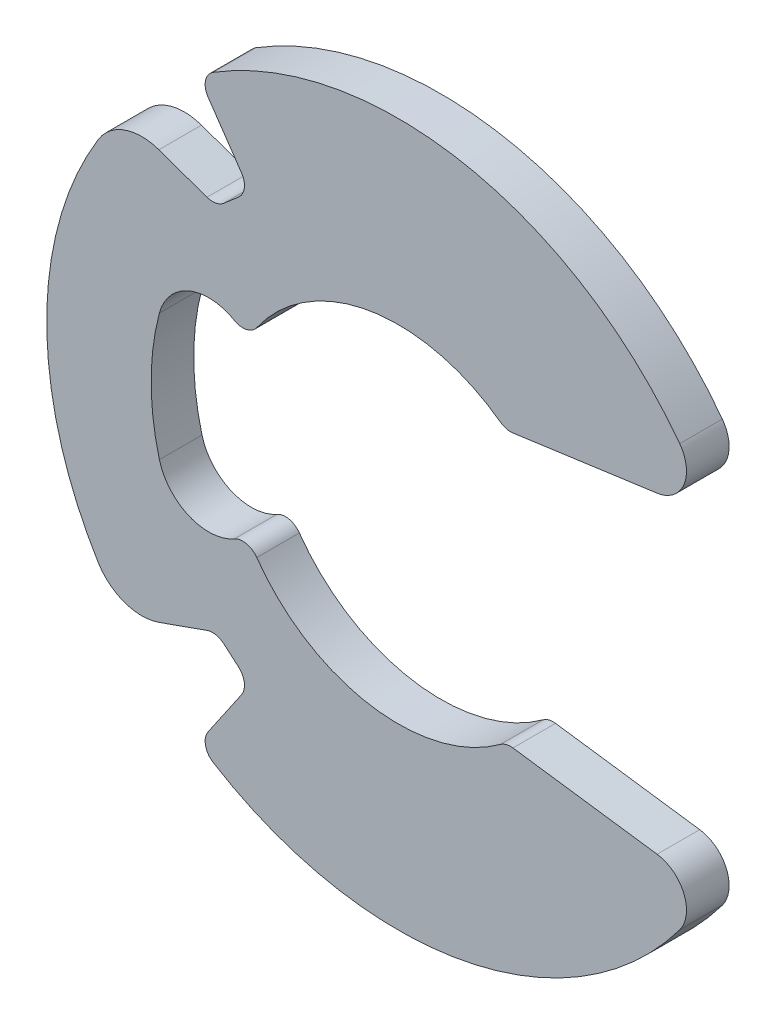
ISO-10303-21;
HEADER;
FILE_DESCRIPTION(('STEP AP214'),'2;1');
FILE_NAME('part.step','',(''),(''),'','','');
FILE_SCHEMA(('AUTOMOTIVE_DESIGN { 1 0 10303 214 1 1 1 1 }'));
ENDSEC;
DATA;
#1=APPLICATION_CONTEXT('core data for automotive mechanical design processes');
#2=APPLICATION_PROTOCOL_DEFINITION('international standard','automotive_design',2000,#1);
#3=PRODUCT_CONTEXT('',#1,'mechanical');
#4=PRODUCT('Part','Part','',(#3));
#5=PRODUCT_RELATED_PRODUCT_CATEGORY('part','',(#4));
#6=PRODUCT_DEFINITION_FORMATION('','',#4);
#7=PRODUCT_DEFINITION_CONTEXT('part definition',#1,'design');
#8=PRODUCT_DEFINITION('design','',#6,#7);
#9=PRODUCT_DEFINITION_SHAPE('','',#8);
#10=(LENGTH_UNIT() NAMED_UNIT(*) SI_UNIT(.MILLI.,.METRE.));
#11=(NAMED_UNIT(*) PLANE_ANGLE_UNIT() SI_UNIT($,.RADIAN.));
#12=(NAMED_UNIT(*) SI_UNIT($,.STERADIAN.) SOLID_ANGLE_UNIT());
#13=UNCERTAINTY_MEASURE_WITH_UNIT(LENGTH_MEASURE(1.E-05),#10,'distance_accuracy_value','');
#14=(GEOMETRIC_REPRESENTATION_CONTEXT(3) GLOBAL_UNCERTAINTY_ASSIGNED_CONTEXT((#13)) GLOBAL_UNIT_ASSIGNED_CONTEXT((#10,
#11,#12)) REPRESENTATION_CONTEXT('',''));
#15=CARTESIAN_POINT('',(0.,0.,0.));
#16=DIRECTION('',(0.,0.,1.));
#17=DIRECTION('',(1.,0.,0.));
#18=AXIS2_PLACEMENT_3D('',#15,#16,#17);
#19=CARTESIAN_POINT('',(0.,0.,1.27));
#20=DIRECTION('',(0.,0.,-1.));
#21=DIRECTION('',(-1.,0.,0.));
#22=AXIS2_PLACEMENT_3D('',#19,#20,#21);
#23=PLANE('',#22);
#24=CARTESIAN_POINT('',(7.57687706687955,-5.66664946537147,1.27));
#25=DIRECTION('',(0.,0.,-1.));
#26=DIRECTION('',(-1.,0.,0.));
#27=AXIS2_PLACEMENT_3D('',#24,#25,#26);
#28=CIRCLE('',#27,1.016);
#29=CARTESIAN_POINT('',(7.71621548730133,-4.66024954258016,1.27));
#30=VERTEX_POINT('',#29);
#31=CARTESIAN_POINT('',(8.39050144990017,-6.27514873682076,1.27));
#32=VERTEX_POINT('',#31);
#33=EDGE_CURVE('E375',#30,#32,#28,.T.);
#34=ORIENTED_EDGE('',*,*,#33,.F.);
#35=DIRECTION('',(0.990551105109562,-0.137144114588364,0.));
#36=VECTOR('',#35,1.);
#37=CARTESIAN_POINT('',(0.,-3.59192148204873,1.27));
#38=LINE('',#37,#36);
#39=CARTESIAN_POINT('',(3.41825205926127,-4.06518646523744,1.27));
#40=VERTEX_POINT('',#39);
#41=EDGE_CURVE('E376',#30,#40,#38,.F.);
#42=ORIENTED_EDGE('',*,*,#41,.T.);
#43=CARTESIAN_POINT('',(3.34858284905039,-4.5683864266331,1.27));
#44=DIRECTION('',(0.,0.,-1.));
#45=DIRECTION('',(-1.,0.,0.));
#46=AXIS2_PLACEMENT_3D('',#43,#44,#45);
#47=CIRCLE('',#46,0.508);
#48=CARTESIAN_POINT('',(3.04826151729699,-4.15866567088125,1.27));
#49=VERTEX_POINT('',#48);
#50=EDGE_CURVE('E19',#49,#40,#47,.T.);
#51=ORIENTED_EDGE('',*,*,#50,.F.);
#52=CARTESIAN_POINT('',(0.,0.,1.27));
#53=DIRECTION('',(0.,0.,-1.));
#54=DIRECTION('',(-1.,0.,0.));
#55=AXIS2_PLACEMENT_3D('',#52,#53,#54);
#56=CIRCLE('',#55,5.1562);
#57=CARTESIAN_POINT('',(-4.21618561440546,-2.96819428354689,1.27));
#58=VERTEX_POINT('',#57);
#59=EDGE_CURVE('E299',#49,#58,#56,.T.);
#60=ORIENTED_EDGE('',*,*,#59,.T.);
#61=CARTESIAN_POINT('',(-4.63157335966707,-3.26062721788648,1.27));
#62=DIRECTION('',(0.,0.,-1.));
#63=DIRECTION('',(-1.,0.,0.));
#64=AXIS2_PLACEMENT_3D('',#61,#62,#63);
#65=CIRCLE('',#64,0.508);
#66=CARTESIAN_POINT('',(-4.88521418696267,-2.82047913970278,1.27));
#67=VERTEX_POINT('',#66);
#68=EDGE_CURVE('E302',#67,#58,#65,.T.);
#69=ORIENTED_EDGE('',*,*,#68,.F.);
#70=CARTESIAN_POINT('',(-5.64613666884946,-1.50003490515168,1.27));
#71=DIRECTION('',(0.,0.,1.));
#72=DIRECTION('',(1.,0.,0.));
#73=AXIS2_PLACEMENT_3D('',#70,#71,#72);
#74=CIRCLE('',#73,1.524);
#75=CARTESIAN_POINT('',(-7.1190418868102,-1.89134835866951,1.27));
#76=VERTEX_POINT('',#75);
#77=EDGE_CURVE('E305',#67,#76,#74,.F.);
#78=ORIENTED_EDGE('',*,*,#77,.T.);
#79=CARTESIAN_POINT('',(0.,0.,1.27));
#80=DIRECTION('',(0.,0.,1.));
#81=DIRECTION('',(1.,0.,0.));
#82=AXIS2_PLACEMENT_3D('',#79,#80,#81);
#83=CIRCLE('',#82,7.366);
#84=CARTESIAN_POINT('',(-7.1190418868102,1.89134835866951,1.27));
#85=VERTEX_POINT('',#84);
#86=EDGE_CURVE('E309',#76,#85,#83,.F.);
#87=ORIENTED_EDGE('',*,*,#86,.T.);
#88=CARTESIAN_POINT('',(-5.64613666884946,1.50003490515168,1.27));
#89=DIRECTION('',(0.,0.,1.));
#90=DIRECTION('',(1.,0.,0.));
#91=AXIS2_PLACEMENT_3D('',#88,#89,#90);
#92=CIRCLE('',#91,1.524);
#93=CARTESIAN_POINT('',(-4.88521418696268,2.82047913970279,1.27));
#94=VERTEX_POINT('',#93);
#95=EDGE_CURVE('E313',#85,#94,#92,.F.);
#96=ORIENTED_EDGE('',*,*,#95,.T.);
#97=CARTESIAN_POINT('',(-4.63157335966708,3.26062721788649,1.27));
#98=DIRECTION('',(0.,0.,1.));
#99=DIRECTION('',(1.,0.,0.));
#100=AXIS2_PLACEMENT_3D('',#97,#98,#99);
#101=CIRCLE('',#100,0.508);
#102=CARTESIAN_POINT('',(-4.21618561440546,2.96819428354689,1.27));
#103=VERTEX_POINT('',#102);
#104=EDGE_CURVE('E315',#103,#94,#101,.F.);
#105=ORIENTED_EDGE('',*,*,#104,.F.);
#106=CARTESIAN_POINT('',(0.,0.,1.27));
#107=DIRECTION('',(0.,0.,-1.));
#108=DIRECTION('',(-1.,0.,0.));
#109=AXIS2_PLACEMENT_3D('',#106,#107,#108);
#110=CIRCLE('',#109,5.1562);
#111=CARTESIAN_POINT('',(3.048261517297,4.15866567088126,1.27));
#112=VERTEX_POINT('',#111);
#113=EDGE_CURVE('E319',#103,#112,#110,.T.);
#114=ORIENTED_EDGE('',*,*,#113,.T.);
#115=CARTESIAN_POINT('',(3.3485828490504,4.5683864266331,1.27));
#116=DIRECTION('',(0.,0.,-1.));
#117=DIRECTION('',(-1.,0.,0.));
#118=AXIS2_PLACEMENT_3D('',#115,#116,#117);
#119=CIRCLE('',#118,0.508);
#120=CARTESIAN_POINT('',(3.41825205926129,4.06518646523745,1.27));
#121=VERTEX_POINT('',#120);
#122=EDGE_CURVE('E323',#121,#112,#119,.T.);
#123=ORIENTED_EDGE('',*,*,#122,.F.);
#124=DIRECTION('',(-0.990551105109562,-0.137144114588364,0.));
#125=VECTOR('',#124,1.);
#126=CARTESIAN_POINT('',(11.2983179723503,5.15619999999999,1.27));
#127=LINE('',#126,#125);
#128=CARTESIAN_POINT('',(7.71621548730134,4.66024954258016,1.27));
#129=VERTEX_POINT('',#128);
#130=EDGE_CURVE('E329',#121,#129,#127,.F.);
#131=ORIENTED_EDGE('',*,*,#130,.T.);
#132=CARTESIAN_POINT('',(7.57687706687956,5.66664946537147,1.27));
#133=DIRECTION('',(0.,0.,-1.));
#134=DIRECTION('',(-1.,0.,0.));
#135=AXIS2_PLACEMENT_3D('',#132,#133,#134);
#136=CIRCLE('',#135,1.016);
#137=CARTESIAN_POINT('',(8.39050144990018,6.27514873682076,1.27));
#138=VERTEX_POINT('',#137);
#139=EDGE_CURVE('E326',#138,#129,#136,.T.);
#140=ORIENTED_EDGE('',*,*,#139,.F.);
#141=CARTESIAN_POINT('',(0.,0.,1.27));
#142=DIRECTION('',(0.,0.,-1.));
#143=DIRECTION('',(-1.,0.,0.));
#144=AXIS2_PLACEMENT_3D('',#141,#142,#143);
#145=CIRCLE('',#144,10.4775);
#146=CARTESIAN_POINT('',(-5.51465485817056,8.90879273780999,1.27));
#147=VERTEX_POINT('',#146);
#148=EDGE_CURVE('E331',#147,#138,#145,.T.);
#149=ORIENTED_EDGE('',*,*,#148,.F.);
#150=CARTESIAN_POINT('',(-5.24727765292592,8.47685127173435,1.27));
#151=DIRECTION('',(0.,0.,-1.));
#152=DIRECTION('',(-1.,0.,0.));
#153=AXIS2_PLACEMENT_3D('',#150,#151,#152);
#154=CIRCLE('',#153,0.508);
#155=CARTESIAN_POINT('',(-5.6664647231543,8.18989099547063,1.27));
#156=VERTEX_POINT('',#155);
#157=EDGE_CURVE('E334',#156,#147,#154,.T.);
#158=ORIENTED_EDGE('',*,*,#157,.F.);
#159=DIRECTION('',(0.564882433590001,-0.825171398087354,0.));
#160=VECTOR('',#159,1.);
#161=CARTESIAN_POINT('',(-7.96096866359448,11.541666359447,1.27));
#162=LINE('',#161,#160);
#163=CARTESIAN_POINT('',(-4.67174469224146,6.73681957776462,1.27));
#164=VERTEX_POINT('',#163);
#165=EDGE_CURVE('E385',#164,#156,#162,.F.);
#166=ORIENTED_EDGE('',*,*,#165,.F.);
#167=CARTESIAN_POINT('',(-5.09093176246983,6.4498593015009,1.27));
#168=DIRECTION('',(0.,0.,-1.));
#169=DIRECTION('',(-1.,0.,0.));
#170=AXIS2_PLACEMENT_3D('',#167,#168,#169);
#171=CIRCLE('',#170,0.508);
#172=CARTESIAN_POINT('',(-4.75923843445855,6.0650950410078,1.27000000000001));
#173=VERTEX_POINT('',#172);
#174=EDGE_CURVE('E338',#164,#173,#171,.T.);
#175=ORIENTED_EDGE('',*,*,#174,.T.);
#176=DIRECTION('',(-0.757409961600578,-0.652939622069462,0.));
#177=VECTOR('',#176,1.);
#178=CARTESIAN_POINT('',(-4.41503502304148,6.36182211981562,1.27000000000001));
#179=LINE('',#178,#177);
#180=CARTESIAN_POINT('',(-5.19974545035898,5.68534761350743,1.27000000000001));
#181=VERTEX_POINT('',#180);
#182=EDGE_CURVE('E389',#181,#173,#179,.F.);
#183=ORIENTED_EDGE('',*,*,#182,.F.);
#184=CARTESIAN_POINT('',(-5.53143877837027,6.07011187400052,1.27));
#185=DIRECTION('',(0.,0.,-1.));
#186=DIRECTION('',(-1.,0.,0.));
#187=AXIS2_PLACEMENT_3D('',#184,#185,#186);
#188=CIRCLE('',#187,0.508);
#189=CARTESIAN_POINT('',(-5.70123922502142,5.59133028672186,1.27));
#190=VERTEX_POINT('',#189);
#191=EDGE_CURVE('E342',#181,#190,#188,.T.);
#192=ORIENTED_EDGE('',*,*,#191,.T.);
#193=DIRECTION('',(-0.942483439524914,0.334252847738487,0.));
#194=VECTOR('',#193,1.);
#195=CARTESIAN_POINT('',(-5.42319262672811,5.49272073732714,1.27));
#196=LINE('',#195,#194);
#197=CARTESIAN_POINT('',(-7.13394241485243,6.09944013892937,1.27));
#198=VERTEX_POINT('',#197);
#199=EDGE_CURVE('E392',#198,#190,#196,.F.);
#200=ORIENTED_EDGE('',*,*,#199,.F.);
#201=CARTESIAN_POINT('',(-7.64334375480589,4.6630953770934,1.27));
#202=DIRECTION('',(0.,0.,-1.));
#203=DIRECTION('',(-1.,0.,0.));
#204=AXIS2_PLACEMENT_3D('',#201,#202,#203);
#205=CIRCLE('',#204,1.524);
#206=CARTESIAN_POINT('',(-8.94433843647498,5.45681373915185,1.27));
#207=VERTEX_POINT('',#206);
#208=EDGE_CURVE('E346',#207,#198,#205,.T.);
#209=ORIENTED_EDGE('',*,*,#208,.F.);
#210=CARTESIAN_POINT('',(0.,0.,1.27));
#211=DIRECTION('',(0.,0.,-1.));
#212=DIRECTION('',(-1.,0.,0.));
#213=AXIS2_PLACEMENT_3D('',#210,#211,#212);
#214=CIRCLE('',#213,10.4775);
#215=CARTESIAN_POINT('',(-8.94433843647497,-5.45681373915185,1.27));
#216=VERTEX_POINT('',#215);
#217=EDGE_CURVE('E350',#216,#207,#214,.T.);
#218=ORIENTED_EDGE('',*,*,#217,.F.);
#219=CARTESIAN_POINT('',(-7.64334375480588,-4.6630953770934,1.27));
#220=DIRECTION('',(0.,0.,-1.));
#221=DIRECTION('',(-1.,0.,0.));
#222=AXIS2_PLACEMENT_3D('',#219,#220,#221);
#223=CIRCLE('',#222,1.524);
#224=CARTESIAN_POINT('',(-7.13394241485243,-6.09944013892937,1.27));
#225=VERTEX_POINT('',#224);
#226=EDGE_CURVE('E354',#225,#216,#223,.T.);
#227=ORIENTED_EDGE('',*,*,#226,.F.);
#228=DIRECTION('',(-0.942483439524914,-0.334252847738487,0.));
#229=VECTOR('',#228,1.);
#230=CARTESIAN_POINT('',(-5.42319262672811,-5.49272073732714,1.27));
#231=LINE('',#230,#229);
#232=CARTESIAN_POINT('',(-5.70123922502142,-5.59133028672186,1.27));
#233=VERTEX_POINT('',#232);
#234=EDGE_CURVE('E395',#225,#233,#231,.F.);
#235=ORIENTED_EDGE('',*,*,#234,.T.);
#236=CARTESIAN_POINT('',(-5.53143877837027,-6.07011187400052,1.27));
#237=DIRECTION('',(0.,0.,-1.));
#238=DIRECTION('',(-1.,0.,0.));
#239=AXIS2_PLACEMENT_3D('',#236,#237,#238);
#240=CIRCLE('',#239,0.508);
#241=CARTESIAN_POINT('',(-5.19974545035898,-5.68534761350743,1.27000000000001));
#242=VERTEX_POINT('',#241);
#243=EDGE_CURVE('E359',#233,#242,#240,.T.);
#244=ORIENTED_EDGE('',*,*,#243,.T.);
#245=DIRECTION('',(-0.757409961600578,0.652939622069462,0.));
#246=VECTOR('',#245,1.);
#247=CARTESIAN_POINT('',(-4.41503502304148,-6.36182211981562,1.27000000000001));
#248=LINE('',#247,#246);
#249=CARTESIAN_POINT('',(-4.75923843445855,-6.0650950410078,1.27000000000001));
#250=VERTEX_POINT('',#249);
#251=EDGE_CURVE('E397',#242,#250,#248,.F.);
#252=ORIENTED_EDGE('',*,*,#251,.T.);
#253=CARTESIAN_POINT('',(-5.09093176246983,-6.4498593015009,1.27));
#254=DIRECTION('',(0.,0.,-1.));
#255=DIRECTION('',(-1.,0.,0.));
#256=AXIS2_PLACEMENT_3D('',#253,#254,#255);
#257=CIRCLE('',#256,0.508);
#258=CARTESIAN_POINT('',(-4.67174469224146,-6.73681957776462,1.27));
#259=VERTEX_POINT('',#258);
#260=EDGE_CURVE('E363',#250,#259,#257,.T.);
#261=ORIENTED_EDGE('',*,*,#260,.T.);
#262=DIRECTION('',(0.56488243359,0.825171398087354,0.));
#263=VECTOR('',#262,1.);
#264=CARTESIAN_POINT('',(-7.96096866359448,-11.541666359447,1.27));
#265=LINE('',#264,#263);
#266=CARTESIAN_POINT('',(-5.66646472315429,-8.18989099547062,1.27));
#267=VERTEX_POINT('',#266);
#268=EDGE_CURVE('E370',#259,#267,#265,.F.);
#269=ORIENTED_EDGE('',*,*,#268,.T.);
#270=CARTESIAN_POINT('',(-5.24727765292592,-8.47685127173434,1.27));
#271=DIRECTION('',(0.,0.,-1.));
#272=DIRECTION('',(-1.,0.,0.));
#273=AXIS2_PLACEMENT_3D('',#270,#271,#272);
#274=CIRCLE('',#273,0.508);
#275=CARTESIAN_POINT('',(-5.51465485817055,-8.90879273780997,1.27));
#276=VERTEX_POINT('',#275);
#277=EDGE_CURVE('E367',#276,#267,#274,.T.);
#278=ORIENTED_EDGE('',*,*,#277,.F.);
#279=CARTESIAN_POINT('',(0.,0.,1.27));
#280=DIRECTION('',(0.,0.,-1.));
#281=DIRECTION('',(-1.,0.,0.));
#282=AXIS2_PLACEMENT_3D('',#279,#280,#281);
#283=CIRCLE('',#282,10.4775);
#284=EDGE_CURVE('E372',#32,#276,#283,.T.);
#285=ORIENTED_EDGE('',*,*,#284,.F.);
#286=EDGE_LOOP('',(#34,#42,#51,#60,#69,#78,#87,#96,#105,#114,#123,#131,#140,#149,#158,#166,#175,
#183,#192,#200,#209,#218,#227,#235,#244,#252,#261,#269,#278,#285));
#287=FACE_BOUND('',#286,.T.);
#288=ADVANCED_FACE('F16',(#287),#23,.F.);
#289=CARTESIAN_POINT('',(0.,-3.59192148204873,-28.9774986298856));
#290=DIRECTION('',(-0.137144114588364,-0.990551105109562,0.));
#291=DIRECTION('',(0.990551105109562,-0.137144114588364,0.));
#292=AXIS2_PLACEMENT_3D('',#289,#290,#291);
#293=PLANE('',#292);
#294=DIRECTION('',(0.,0.,-1.));
#295=VECTOR('',#294,1.);
#296=CARTESIAN_POINT('',(7.71621548730133,-4.66024954258016,1.27));
#297=LINE('',#296,#295);
#298=CARTESIAN_POINT('',(7.71621548730133,-4.66024954258016,0.));
#299=VERTEX_POINT('',#298);
#300=EDGE_CURVE('E221',#299,#30,#297,.F.);
#301=ORIENTED_EDGE('',*,*,#300,.F.);
#302=DIRECTION('',(0.990551105109562,-0.137144114588363,0.));
#303=VECTOR('',#302,1.);
#304=CARTESIAN_POINT('',(3.41825205926127,-4.06518646523744,0.));
#305=LINE('',#304,#303);
#306=CARTESIAN_POINT('',(3.41825205926127,-4.06518646523744,0.));
#307=VERTEX_POINT('',#306);
#308=EDGE_CURVE('E216',#307,#299,#305,.T.);
#309=ORIENTED_EDGE('',*,*,#308,.F.);
#310=DIRECTION('',(0.,0.,-1.));
#311=VECTOR('',#310,1.);
#312=CARTESIAN_POINT('',(3.41825205926127,-4.06518646523744,1.27));
#313=LINE('',#312,#311);
#314=EDGE_CURVE('E219',#40,#307,#313,.T.);
#315=ORIENTED_EDGE('',*,*,#314,.F.);
#316=ORIENTED_EDGE('',*,*,#41,.F.);
#317=EDGE_LOOP('',(#301,#309,#315,#316));
#318=FACE_BOUND('',#317,.T.);
#319=ADVANCED_FACE('F217',(#318),#293,.F.);
#320=CARTESIAN_POINT('',(7.57687706687955,-5.66664946537147,1.27));
#321=DIRECTION('',(0.,0.,-1.));
#322=DIRECTION('',(-1.,0.,0.));
#323=AXIS2_PLACEMENT_3D('',#320,#321,#322);
#324=CYLINDRICAL_SURFACE('',#323,1.016);
#325=CARTESIAN_POINT('',(7.57687706687955,-5.66664946537147,0.));
#326=DIRECTION('',(0.,0.,-1.));
#327=DIRECTION('',(-1.,0.,0.));
#328=AXIS2_PLACEMENT_3D('',#325,#326,#327);
#329=CIRCLE('',#328,1.016);
#330=CARTESIAN_POINT('',(8.39050144990017,-6.27514873682076,0.));
#331=VERTEX_POINT('',#330);
#332=EDGE_CURVE('E225',#299,#331,#329,.T.);
#333=ORIENTED_EDGE('',*,*,#332,.F.);
#334=ORIENTED_EDGE('',*,*,#300,.T.);
#335=ORIENTED_EDGE('',*,*,#33,.T.);
#336=DIRECTION('',(0.,0.,-1.));
#337=VECTOR('',#336,1.);
#338=CARTESIAN_POINT('',(8.39050144990017,-6.27514873682076,1.27));
#339=LINE('',#338,#337);
#340=EDGE_CURVE('E374',#331,#32,#339,.F.);
#341=ORIENTED_EDGE('',*,*,#340,.F.);
#342=EDGE_LOOP('',(#333,#334,#335,#341));
#343=FACE_BOUND('',#342,.T.);
#344=ADVANCED_FACE('F413',(#343),#324,.T.);
#345=CARTESIAN_POINT('',(0.,0.,1.27));
#346=DIRECTION('',(0.,0.,-1.));
#347=DIRECTION('',(-1.,0.,0.));
#348=AXIS2_PLACEMENT_3D('',#345,#346,#347);
#349=CYLINDRICAL_SURFACE('',#348,10.4775);
#350=ORIENTED_EDGE('',*,*,#284,.T.);
#351=DIRECTION('',(0.,0.,-1.));
#352=VECTOR('',#351,1.);
#353=CARTESIAN_POINT('',(-5.51465485817055,-8.90879273780998,1.27));
#354=LINE('',#353,#352);
#355=CARTESIAN_POINT('',(-5.51465485817055,-8.90879273780997,0.));
#356=VERTEX_POINT('',#355);
#357=EDGE_CURVE('E371',#356,#276,#354,.F.);
#358=ORIENTED_EDGE('',*,*,#357,.F.);
#359=CARTESIAN_POINT('',(0.,0.,0.));
#360=DIRECTION('',(0.,0.,-1.));
#361=DIRECTION('',(-1.,0.,0.));
#362=AXIS2_PLACEMENT_3D('',#359,#360,#361);
#363=CIRCLE('',#362,10.4775);
#364=EDGE_CURVE('E295',#331,#356,#363,.T.);
#365=ORIENTED_EDGE('',*,*,#364,.F.);
#366=ORIENTED_EDGE('',*,*,#340,.T.);
#367=EDGE_LOOP('',(#350,#358,#365,#366));
#368=FACE_BOUND('',#367,.T.);
#369=ADVANCED_FACE('F412',(#368),#349,.T.);
#370=CARTESIAN_POINT('',(-5.24727765292592,-8.47685127173434,1.27));
#371=DIRECTION('',(0.,0.,-1.));
#372=DIRECTION('',(-1.,0.,0.));
#373=AXIS2_PLACEMENT_3D('',#370,#371,#372);
#374=CYLINDRICAL_SURFACE('',#373,0.508);
#375=DIRECTION('',(0.,0.,1.));
#376=VECTOR('',#375,1.);
#377=CARTESIAN_POINT('',(-5.66646472315429,-8.18989099547062,-28.9619533727259));
#378=LINE('',#377,#376);
#379=CARTESIAN_POINT('',(-5.6664647231543,-8.18989099547062,0.));
#380=VERTEX_POINT('',#379);
#381=EDGE_CURVE('E366',#267,#380,#378,.F.);
#382=ORIENTED_EDGE('',*,*,#381,.T.);
#383=CARTESIAN_POINT('',(-5.24727765292592,-8.47685127173434,0.));
#384=DIRECTION('',(0.,0.,-1.));
#385=DIRECTION('',(-1.,0.,0.));
#386=AXIS2_PLACEMENT_3D('',#383,#384,#385);
#387=CIRCLE('',#386,0.508);
#388=EDGE_CURVE('E293',#356,#380,#387,.T.);
#389=ORIENTED_EDGE('',*,*,#388,.F.);
#390=ORIENTED_EDGE('',*,*,#357,.T.);
#391=ORIENTED_EDGE('',*,*,#277,.T.);
#392=EDGE_LOOP('',(#382,#389,#390,#391));
#393=FACE_BOUND('',#392,.T.);
#394=ADVANCED_FACE('F415',(#393),#374,.T.);
#395=CARTESIAN_POINT('',(-7.96096866359448,-11.541666359447,-28.9619533727259));
#396=DIRECTION('',(0.825171398087354,-0.56488243359,0.));
#397=DIRECTION('',(0.56488243359,0.825171398087354,0.));
#398=AXIS2_PLACEMENT_3D('',#395,#396,#397);
#399=PLANE('',#398);
#400=ORIENTED_EDGE('',*,*,#381,.F.);
#401=ORIENTED_EDGE('',*,*,#268,.F.);
#402=DIRECTION('',(0.,0.,-1.));
#403=VECTOR('',#402,1.);
#404=CARTESIAN_POINT('',(-4.67174469224146,-6.73681957776462,-28.9619533727259));
#405=LINE('',#404,#403);
#406=CARTESIAN_POINT('',(-4.67174469224146,-6.73681957776462,0.));
#407=VERTEX_POINT('',#406);
#408=EDGE_CURVE('E365',#259,#407,#405,.T.);
#409=ORIENTED_EDGE('',*,*,#408,.T.);
#410=DIRECTION('',(0.564882433590003,0.825171398087353,0.));
#411=VECTOR('',#410,1.);
#412=CARTESIAN_POINT('',(-5.6664647231543,-8.18989099547062,0.));
#413=LINE('',#412,#411);
#414=EDGE_CURVE('E292',#380,#407,#413,.T.);
#415=ORIENTED_EDGE('',*,*,#414,.F.);
#416=EDGE_LOOP('',(#400,#401,#409,#415));
#417=FACE_BOUND('',#416,.T.);
#418=ADVANCED_FACE('F417',(#417),#399,.F.);
#419=CARTESIAN_POINT('',(-5.09093176246983,-6.4498593015009,-28.9619533727259));
#420=DIRECTION('',(0.,0.,-1.));
#421=DIRECTION('',(-1.,0.,0.));
#422=AXIS2_PLACEMENT_3D('',#419,#420,#421);
#423=CYLINDRICAL_SURFACE('',#422,0.508);
#424=ORIENTED_EDGE('',*,*,#408,.F.);
#425=ORIENTED_EDGE('',*,*,#260,.F.);
#426=DIRECTION('',(0.,0.,1.));
#427=VECTOR('',#426,1.);
#428=CARTESIAN_POINT('',(-4.75923843445855,-6.0650950410078,-28.9619533727259));
#429=LINE('',#428,#427);
#430=CARTESIAN_POINT('',(-4.75923843445855,-6.0650950410078,0.));
#431=VERTEX_POINT('',#430);
#432=EDGE_CURVE('E362',#250,#431,#429,.F.);
#433=ORIENTED_EDGE('',*,*,#432,.T.);
#434=CARTESIAN_POINT('',(-5.09093176246983,-6.4498593015009,0.));
#435=DIRECTION('',(0.,0.,-1.));
#436=DIRECTION('',(-1.,0.,0.));
#437=AXIS2_PLACEMENT_3D('',#434,#435,#436);
#438=CIRCLE('',#437,0.508);
#439=EDGE_CURVE('E289',#407,#431,#438,.F.);
#440=ORIENTED_EDGE('',*,*,#439,.F.);
#441=EDGE_LOOP('',(#424,#425,#433,#440));
#442=FACE_BOUND('',#441,.T.);
#443=ADVANCED_FACE('F462',(#442),#423,.F.);
#444=CARTESIAN_POINT('',(-4.41503502304148,-6.36182211981562,-28.9619533727259));
#445=DIRECTION('',(0.652939622069462,0.757409961600578,0.));
#446=DIRECTION('',(-0.757409961600578,0.652939622069462,0.));
#447=AXIS2_PLACEMENT_3D('',#444,#445,#446);
#448=PLANE('',#447);
#449=ORIENTED_EDGE('',*,*,#432,.F.);
#450=ORIENTED_EDGE('',*,*,#251,.F.);
#451=DIRECTION('',(0.,0.,-1.));
#452=VECTOR('',#451,1.);
#453=CARTESIAN_POINT('',(-5.19974545035899,-5.68534761350743,-28.9619533727259));
#454=LINE('',#453,#452);
#455=CARTESIAN_POINT('',(-5.19974545035898,-5.68534761350743,0.));
#456=VERTEX_POINT('',#455);
#457=EDGE_CURVE('E361',#242,#456,#454,.T.);
#458=ORIENTED_EDGE('',*,*,#457,.T.);
#459=DIRECTION('',(-0.757409961600581,0.652939622069458,0.));
#460=VECTOR('',#459,1.);
#461=CARTESIAN_POINT('',(-4.75923843445854,-6.0650950410078,0.));
#462=LINE('',#461,#460);
#463=EDGE_CURVE('E288',#431,#456,#462,.T.);
#464=ORIENTED_EDGE('',*,*,#463,.F.);
#465=EDGE_LOOP('',(#449,#450,#458,#464));
#466=FACE_BOUND('',#465,.T.);
#467=ADVANCED_FACE('F466',(#466),#448,.F.);
#468=CARTESIAN_POINT('',(-5.53143877837027,-6.07011187400052,-28.9619533727259));
#469=DIRECTION('',(0.,0.,-1.));
#470=DIRECTION('',(-1.,0.,0.));
#471=AXIS2_PLACEMENT_3D('',#468,#469,#470);
#472=CYLINDRICAL_SURFACE('',#471,0.508);
#473=ORIENTED_EDGE('',*,*,#457,.F.);
#474=ORIENTED_EDGE('',*,*,#243,.F.);
#475=DIRECTION('',(0.,0.,1.));
#476=VECTOR('',#475,1.);
#477=CARTESIAN_POINT('',(-5.70123922502142,-5.59133028672186,-28.9619533727259));
#478=LINE('',#477,#476);
#479=CARTESIAN_POINT('',(-5.70123922502142,-5.59133028672186,0.));
#480=VERTEX_POINT('',#479);
#481=EDGE_CURVE('E358',#233,#480,#478,.F.);
#482=ORIENTED_EDGE('',*,*,#481,.T.);
#483=CARTESIAN_POINT('',(-5.53143877837027,-6.07011187400052,0.));
#484=DIRECTION('',(0.,0.,-1.));
#485=DIRECTION('',(-1.,0.,0.));
#486=AXIS2_PLACEMENT_3D('',#483,#484,#485);
#487=CIRCLE('',#486,0.508);
#488=EDGE_CURVE('E285',#456,#480,#487,.F.);
#489=ORIENTED_EDGE('',*,*,#488,.F.);
#490=EDGE_LOOP('',(#473,#474,#482,#489));
#491=FACE_BOUND('',#490,.T.);
#492=ADVANCED_FACE('F472',(#491),#472,.F.);
#493=CARTESIAN_POINT('',(-5.42319262672811,-5.49272073732714,-28.9619533727259));
#494=DIRECTION('',(-0.334252847738487,0.942483439524914,0.));
#495=DIRECTION('',(-0.942483439524914,-0.334252847738487,0.));
#496=AXIS2_PLACEMENT_3D('',#493,#494,#495);
#497=PLANE('',#496);
#498=ORIENTED_EDGE('',*,*,#481,.F.);
#499=ORIENTED_EDGE('',*,*,#234,.F.);
#500=DIRECTION('',(0.,0.,-1.));
#501=VECTOR('',#500,1.);
#502=CARTESIAN_POINT('',(-7.13394241485243,-6.09944013892937,1.27));
#503=LINE('',#502,#501);
#504=CARTESIAN_POINT('',(-7.13394241485243,-6.09944013892937,0.));
#505=VERTEX_POINT('',#504);
#506=EDGE_CURVE('E357',#505,#225,#503,.F.);
#507=ORIENTED_EDGE('',*,*,#506,.F.);
#508=DIRECTION('',(-0.942483439524914,-0.334252847738488,0.));
#509=VECTOR('',#508,1.);
#510=CARTESIAN_POINT('',(-5.70123922502142,-5.59133028672186,0.));
#511=LINE('',#510,#509);
#512=EDGE_CURVE('E284',#480,#505,#511,.T.);
#513=ORIENTED_EDGE('',*,*,#512,.F.);
#514=EDGE_LOOP('',(#498,#499,#507,#513));
#515=FACE_BOUND('',#514,.T.);
#516=ADVANCED_FACE('F477',(#515),#497,.F.);
#517=CARTESIAN_POINT('',(-7.64334375480588,-4.6630953770934,1.27));
#518=DIRECTION('',(0.,0.,-1.));
#519=DIRECTION('',(-1.,0.,0.));
#520=AXIS2_PLACEMENT_3D('',#517,#518,#519);
#521=CYLINDRICAL_SURFACE('',#520,1.524);
#522=CARTESIAN_POINT('',(-7.64334375480588,-4.6630953770934,0.));
#523=DIRECTION('',(0.,0.,-1.));
#524=DIRECTION('',(-1.,0.,0.));
#525=AXIS2_PLACEMENT_3D('',#522,#523,#524);
#526=CIRCLE('',#525,1.524);
#527=CARTESIAN_POINT('',(-8.94433843647497,-5.45681373915185,0.));
#528=VERTEX_POINT('',#527);
#529=EDGE_CURVE('E281',#505,#528,#526,.T.);
#530=ORIENTED_EDGE('',*,*,#529,.F.);
#531=ORIENTED_EDGE('',*,*,#506,.T.);
#532=ORIENTED_EDGE('',*,*,#226,.T.);
#533=DIRECTION('',(0.,0.,-1.));
#534=VECTOR('',#533,1.);
#535=CARTESIAN_POINT('',(-8.94433843647497,-5.45681373915185,1.27));
#536=LINE('',#535,#534);
#537=EDGE_CURVE('E353',#528,#216,#536,.F.);
#538=ORIENTED_EDGE('',*,*,#537,.F.);
#539=EDGE_LOOP('',(#530,#531,#532,#538));
#540=FACE_BOUND('',#539,.T.);
#541=ADVANCED_FACE('F558',(#540),#521,.T.);
#542=CARTESIAN_POINT('',(0.,0.,1.27));
#543=DIRECTION('',(0.,0.,-1.));
#544=DIRECTION('',(-1.,0.,0.));
#545=AXIS2_PLACEMENT_3D('',#542,#543,#544);
#546=CYLINDRICAL_SURFACE('',#545,10.4775);
#547=DIRECTION('',(0.,0.,-1.));
#548=VECTOR('',#547,1.);
#549=CARTESIAN_POINT('',(-8.94433843647498,5.45681373915185,1.27));
#550=LINE('',#549,#548);
#551=CARTESIAN_POINT('',(-8.94433843647498,5.45681373915185,0.));
#552=VERTEX_POINT('',#551);
#553=EDGE_CURVE('E349',#552,#207,#550,.F.);
#554=ORIENTED_EDGE('',*,*,#553,.F.);
#555=CARTESIAN_POINT('',(0.,0.,0.));
#556=DIRECTION('',(0.,0.,-1.));
#557=DIRECTION('',(-1.,0.,0.));
#558=AXIS2_PLACEMENT_3D('',#555,#556,#557);
#559=CIRCLE('',#558,10.4775);
#560=EDGE_CURVE('E279',#528,#552,#559,.T.);
#561=ORIENTED_EDGE('',*,*,#560,.F.);
#562=ORIENTED_EDGE('',*,*,#537,.T.);
#563=ORIENTED_EDGE('',*,*,#217,.T.);
#564=EDGE_LOOP('',(#554,#561,#562,#563));
#565=FACE_BOUND('',#564,.T.);
#566=ADVANCED_FACE('F556',(#565),#546,.T.);
#567=CARTESIAN_POINT('',(-7.64334375480589,4.6630953770934,1.27));
#568=DIRECTION('',(0.,0.,-1.));
#569=DIRECTION('',(-1.,0.,0.));
#570=AXIS2_PLACEMENT_3D('',#567,#568,#569);
#571=CYLINDRICAL_SURFACE('',#570,1.524);
#572=CARTESIAN_POINT('',(-7.64334375480589,4.6630953770934,0.));
#573=DIRECTION('',(0.,0.,-1.));
#574=DIRECTION('',(-1.,0.,0.));
#575=AXIS2_PLACEMENT_3D('',#572,#573,#574);
#576=CIRCLE('',#575,1.524);
#577=CARTESIAN_POINT('',(-7.13394241485243,6.09944013892937,0.));
#578=VERTEX_POINT('',#577);
#579=EDGE_CURVE('E276',#552,#578,#576,.T.);
#580=ORIENTED_EDGE('',*,*,#579,.F.);
#581=ORIENTED_EDGE('',*,*,#553,.T.);
#582=ORIENTED_EDGE('',*,*,#208,.T.);
#583=DIRECTION('',(0.,0.,1.));
#584=VECTOR('',#583,1.);
#585=CARTESIAN_POINT('',(-7.13394241485243,6.09944013892937,-28.9619533727259));
#586=LINE('',#585,#584);
#587=EDGE_CURVE('E345',#578,#198,#586,.T.);
#588=ORIENTED_EDGE('',*,*,#587,.F.);
#589=EDGE_LOOP('',(#580,#581,#582,#588));
#590=FACE_BOUND('',#589,.T.);
#591=ADVANCED_FACE('F552',(#590),#571,.T.);
#592=CARTESIAN_POINT('',(-5.42319262672811,5.49272073732714,-28.9619533727259));
#593=DIRECTION('',(0.334252847738487,0.942483439524914,0.));
#594=DIRECTION('',(-0.942483439524914,0.334252847738487,0.));
#595=AXIS2_PLACEMENT_3D('',#592,#593,#594);
#596=PLANE('',#595);
#597=DIRECTION('',(0.942483439524914,-0.334252847738487,0.));
#598=VECTOR('',#597,1.);
#599=CARTESIAN_POINT('',(-7.13394241485243,6.09944013892937,0.));
#600=LINE('',#599,#598);
#601=CARTESIAN_POINT('',(-5.70123922502142,5.59133028672186,0.));
#602=VERTEX_POINT('',#601);
#603=EDGE_CURVE('E275',#578,#602,#600,.T.);
#604=ORIENTED_EDGE('',*,*,#603,.F.);
#605=ORIENTED_EDGE('',*,*,#587,.T.);
#606=ORIENTED_EDGE('',*,*,#199,.T.);
#607=DIRECTION('',(0.,0.,-1.));
#608=VECTOR('',#607,1.);
#609=CARTESIAN_POINT('',(-5.70123922502142,5.59133028672186,-28.9619533727259));
#610=LINE('',#609,#608);
#611=EDGE_CURVE('E344',#190,#602,#610,.T.);
#612=ORIENTED_EDGE('',*,*,#611,.T.);
#613=EDGE_LOOP('',(#604,#605,#606,#612));
#614=FACE_BOUND('',#613,.T.);
#615=ADVANCED_FACE('F549',(#614),#596,.T.);
#616=CARTESIAN_POINT('',(-5.53143877837027,6.07011187400052,-28.9619533727259));
#617=DIRECTION('',(0.,0.,-1.));
#618=DIRECTION('',(-1.,0.,0.));
#619=AXIS2_PLACEMENT_3D('',#616,#617,#618);
#620=CYLINDRICAL_SURFACE('',#619,0.508);
#621=ORIENTED_EDGE('',*,*,#611,.F.);
#622=ORIENTED_EDGE('',*,*,#191,.F.);
#623=DIRECTION('',(0.,0.,1.));
#624=VECTOR('',#623,1.);
#625=CARTESIAN_POINT('',(-5.19974545035898,5.68534761350743,-28.9619533727259));
#626=LINE('',#625,#624);
#627=CARTESIAN_POINT('',(-5.19974545035898,5.68534761350743,0.));
#628=VERTEX_POINT('',#627);
#629=EDGE_CURVE('E341',#628,#181,#626,.T.);
#630=ORIENTED_EDGE('',*,*,#629,.F.);
#631=CARTESIAN_POINT('',(-5.53143877837027,6.07011187400052,0.));
#632=DIRECTION('',(0.,0.,-1.));
#633=DIRECTION('',(-1.,0.,0.));
#634=AXIS2_PLACEMENT_3D('',#631,#632,#633);
#635=CIRCLE('',#634,0.508);
#636=EDGE_CURVE('E272',#602,#628,#635,.F.);
#637=ORIENTED_EDGE('',*,*,#636,.F.);
#638=EDGE_LOOP('',(#621,#622,#630,#637));
#639=FACE_BOUND('',#638,.T.);
#640=ADVANCED_FACE('F545',(#639),#620,.F.);
#641=CARTESIAN_POINT('',(-4.41503502304148,6.36182211981562,-28.9619533727259));
#642=DIRECTION('',(-0.652939622069462,0.757409961600578,0.));
#643=DIRECTION('',(-0.757409961600578,-0.652939622069462,0.));
#644=AXIS2_PLACEMENT_3D('',#641,#642,#643);
#645=PLANE('',#644);
#646=DIRECTION('',(0.757409961600573,0.652939622069468,0.));
#647=VECTOR('',#646,1.);
#648=CARTESIAN_POINT('',(-5.19974545035898,5.68534761350743,0.));
#649=LINE('',#648,#647);
#650=CARTESIAN_POINT('',(-4.75923843445855,6.0650950410078,0.));
#651=VERTEX_POINT('',#650);
#652=EDGE_CURVE('E271',#628,#651,#649,.T.);
#653=ORIENTED_EDGE('',*,*,#652,.F.);
#654=ORIENTED_EDGE('',*,*,#629,.T.);
#655=ORIENTED_EDGE('',*,*,#182,.T.);
#656=DIRECTION('',(0.,0.,-1.));
#657=VECTOR('',#656,1.);
#658=CARTESIAN_POINT('',(-4.75923843445855,6.0650950410078,-28.9619533727259));
#659=LINE('',#658,#657);
#660=EDGE_CURVE('E340',#173,#651,#659,.T.);
#661=ORIENTED_EDGE('',*,*,#660,.T.);
#662=EDGE_LOOP('',(#653,#654,#655,#661));
#663=FACE_BOUND('',#662,.T.);
#664=ADVANCED_FACE('F541',(#663),#645,.T.);
#665=CARTESIAN_POINT('',(-5.09093176246983,6.4498593015009,-28.9619533727259));
#666=DIRECTION('',(0.,0.,-1.));
#667=DIRECTION('',(-1.,0.,0.));
#668=AXIS2_PLACEMENT_3D('',#665,#666,#667);
#669=CYLINDRICAL_SURFACE('',#668,0.508);
#670=ORIENTED_EDGE('',*,*,#660,.F.);
#671=ORIENTED_EDGE('',*,*,#174,.F.);
#672=DIRECTION('',(0.,0.,1.));
#673=VECTOR('',#672,1.);
#674=CARTESIAN_POINT('',(-4.67174469224146,6.73681957776462,-28.9619533727259));
#675=LINE('',#674,#673);
#676=CARTESIAN_POINT('',(-4.67174469224146,6.73681957776462,0.));
#677=VERTEX_POINT('',#676);
#678=EDGE_CURVE('E388',#677,#164,#675,.T.);
#679=ORIENTED_EDGE('',*,*,#678,.F.);
#680=CARTESIAN_POINT('',(-5.09093176246983,6.4498593015009,0.));
#681=DIRECTION('',(0.,0.,-1.));
#682=DIRECTION('',(-1.,0.,0.));
#683=AXIS2_PLACEMENT_3D('',#680,#681,#682);
#684=CIRCLE('',#683,0.508);
#685=EDGE_CURVE('E268',#651,#677,#684,.F.);
#686=ORIENTED_EDGE('',*,*,#685,.F.);
#687=EDGE_LOOP('',(#670,#671,#679,#686));
#688=FACE_BOUND('',#687,.T.);
#689=ADVANCED_FACE('F537',(#688),#669,.F.);
#690=CARTESIAN_POINT('',(-7.96096866359448,11.541666359447,-28.9619533727259));
#691=DIRECTION('',(-0.825171398087354,-0.564882433590001,0.));
#692=DIRECTION('',(0.564882433590001,-0.825171398087354,0.));
#693=AXIS2_PLACEMENT_3D('',#690,#691,#692);
#694=PLANE('',#693);
#695=DIRECTION('',(-0.56488243359,0.825171398087354,0.));
#696=VECTOR('',#695,1.);
#697=CARTESIAN_POINT('',(-4.67174469224146,6.73681957776462,0.));
#698=LINE('',#697,#696);
#699=CARTESIAN_POINT('',(-5.6664647231543,8.18989099547063,0.));
#700=VERTEX_POINT('',#699);
#701=EDGE_CURVE('E267',#677,#700,#698,.T.);
#702=ORIENTED_EDGE('',*,*,#701,.F.);
#703=ORIENTED_EDGE('',*,*,#678,.T.);
#704=ORIENTED_EDGE('',*,*,#165,.T.);
#705=DIRECTION('',(0.,0.,-1.));
#706=VECTOR('',#705,1.);
#707=CARTESIAN_POINT('',(-5.6664647231543,8.18989099547063,1.27));
#708=LINE('',#707,#706);
#709=EDGE_CURVE('E337',#700,#156,#708,.F.);
#710=ORIENTED_EDGE('',*,*,#709,.F.);
#711=EDGE_LOOP('',(#702,#703,#704,#710));
#712=FACE_BOUND('',#711,.T.);
#713=ADVANCED_FACE('F533',(#712),#694,.T.);
#714=CARTESIAN_POINT('',(-5.24727765292592,8.47685127173435,1.27));
#715=DIRECTION('',(0.,0.,-1.));
#716=DIRECTION('',(-1.,0.,0.));
#717=AXIS2_PLACEMENT_3D('',#714,#715,#716);
#718=CYLINDRICAL_SURFACE('',#717,0.508);
#719=DIRECTION('',(0.,0.,-1.));
#720=VECTOR('',#719,1.);
#721=CARTESIAN_POINT('',(-5.51465485817056,8.90879273780999,1.27));
#722=LINE('',#721,#720);
#723=CARTESIAN_POINT('',(-5.51465485817056,8.90879273780999,0.));
#724=VERTEX_POINT('',#723);
#725=EDGE_CURVE('E333',#724,#147,#722,.F.);
#726=ORIENTED_EDGE('',*,*,#725,.F.);
#727=CARTESIAN_POINT('',(-5.24727765292592,8.47685127173435,0.));
#728=DIRECTION('',(0.,0.,-1.));
#729=DIRECTION('',(-1.,0.,0.));
#730=AXIS2_PLACEMENT_3D('',#727,#728,#729);
#731=CIRCLE('',#730,0.508);
#732=EDGE_CURVE('E265',#700,#724,#731,.T.);
#733=ORIENTED_EDGE('',*,*,#732,.F.);
#734=ORIENTED_EDGE('',*,*,#709,.T.);
#735=ORIENTED_EDGE('',*,*,#157,.T.);
#736=EDGE_LOOP('',(#726,#733,#734,#735));
#737=FACE_BOUND('',#736,.T.);
#738=ADVANCED_FACE('F529',(#737),#718,.T.);
#739=CARTESIAN_POINT('',(0.,0.,1.27));
#740=DIRECTION('',(0.,0.,-1.));
#741=DIRECTION('',(-1.,0.,0.));
#742=AXIS2_PLACEMENT_3D('',#739,#740,#741);
#743=CYLINDRICAL_SURFACE('',#742,10.4775);
#744=CARTESIAN_POINT('',(0.,0.,0.));
#745=DIRECTION('',(0.,0.,-1.));
#746=DIRECTION('',(-1.,0.,0.));
#747=AXIS2_PLACEMENT_3D('',#744,#745,#746);
#748=CIRCLE('',#747,10.4775);
#749=CARTESIAN_POINT('',(8.39050144990018,6.27514873682076,0.));
#750=VERTEX_POINT('',#749);
#751=EDGE_CURVE('E262',#724,#750,#748,.T.);
#752=ORIENTED_EDGE('',*,*,#751,.F.);
#753=ORIENTED_EDGE('',*,*,#725,.T.);
#754=ORIENTED_EDGE('',*,*,#148,.T.);
#755=DIRECTION('',(0.,0.,-1.));
#756=VECTOR('',#755,1.);
#757=CARTESIAN_POINT('',(8.39050144990018,6.27514873682076,1.27));
#758=LINE('',#757,#756);
#759=EDGE_CURVE('E330',#750,#138,#758,.F.);
#760=ORIENTED_EDGE('',*,*,#759,.F.);
#761=EDGE_LOOP('',(#752,#753,#754,#760));
#762=FACE_BOUND('',#761,.T.);
#763=ADVANCED_FACE('F526',(#762),#743,.T.);
#764=CARTESIAN_POINT('',(7.57687706687956,5.66664946537147,1.27));
#765=DIRECTION('',(0.,0.,-1.));
#766=DIRECTION('',(-1.,0.,0.));
#767=AXIS2_PLACEMENT_3D('',#764,#765,#766);
#768=CYLINDRICAL_SURFACE('',#767,1.016);
#769=ORIENTED_EDGE('',*,*,#139,.T.);
#770=DIRECTION('',(0.,0.,1.));
#771=VECTOR('',#770,1.);
#772=CARTESIAN_POINT('',(7.71621548730134,4.66024954258016,-28.9774986298856));
#773=LINE('',#772,#771);
#774=CARTESIAN_POINT('',(7.71621548730134,4.66024954258016,0.));
#775=VERTEX_POINT('',#774);
#776=EDGE_CURVE('E384',#129,#775,#773,.F.);
#777=ORIENTED_EDGE('',*,*,#776,.T.);
#778=CARTESIAN_POINT('',(7.57687706687956,5.66664946537147,0.));
#779=DIRECTION('',(0.,0.,-1.));
#780=DIRECTION('',(-1.,0.,0.));
#781=AXIS2_PLACEMENT_3D('',#778,#779,#780);
#782=CIRCLE('',#781,1.016);
#783=EDGE_CURVE('E259',#750,#775,#782,.T.);
#784=ORIENTED_EDGE('',*,*,#783,.F.);
#785=ORIENTED_EDGE('',*,*,#759,.T.);
#786=EDGE_LOOP('',(#769,#777,#784,#785));
#787=FACE_BOUND('',#786,.T.);
#788=ADVANCED_FACE('F523',(#787),#768,.T.);
#789=CARTESIAN_POINT('',(11.2983179723503,5.15619999999999,-28.9774986298856));
#790=DIRECTION('',(-0.137144114588364,0.990551105109562,0.));
#791=DIRECTION('',(-0.990551105109562,-0.137144114588364,0.));
#792=AXIS2_PLACEMENT_3D('',#789,#790,#791);
#793=PLANE('',#792);
#794=ORIENTED_EDGE('',*,*,#776,.F.);
#795=ORIENTED_EDGE('',*,*,#130,.F.);
#796=DIRECTION('',(0.,0.,-1.));
#797=VECTOR('',#796,1.);
#798=CARTESIAN_POINT('',(3.41825205926129,4.06518646523745,1.27));
#799=LINE('',#798,#797);
#800=CARTESIAN_POINT('',(3.41825205926129,4.06518646523745,0.));
#801=VERTEX_POINT('',#800);
#802=EDGE_CURVE('E325',#801,#121,#799,.F.);
#803=ORIENTED_EDGE('',*,*,#802,.F.);
#804=DIRECTION('',(-0.990551105109562,-0.137144114588364,0.));
#805=VECTOR('',#804,1.);
#806=CARTESIAN_POINT('',(7.71621548730134,4.66024954258016,0.));
#807=LINE('',#806,#805);
#808=EDGE_CURVE('E258',#775,#801,#807,.T.);
#809=ORIENTED_EDGE('',*,*,#808,.F.);
#810=EDGE_LOOP('',(#794,#795,#803,#809));
#811=FACE_BOUND('',#810,.T.);
#812=ADVANCED_FACE('F492',(#811),#793,.F.);
#813=CARTESIAN_POINT('',(3.3485828490504,4.5683864266331,1.27));
#814=DIRECTION('',(0.,0.,-1.));
#815=DIRECTION('',(-1.,0.,0.));
#816=AXIS2_PLACEMENT_3D('',#813,#814,#815);
#817=CYLINDRICAL_SURFACE('',#816,0.508);
#818=ORIENTED_EDGE('',*,*,#122,.T.);
#819=DIRECTION('',(0.,0.,-1.));
#820=VECTOR('',#819,1.);
#821=CARTESIAN_POINT('',(3.048261517297,4.15866567088126,1.27));
#822=LINE('',#821,#820);
#823=CARTESIAN_POINT('',(3.048261517297,4.15866567088126,0.));
#824=VERTEX_POINT('',#823);
#825=EDGE_CURVE('E322',#112,#824,#822,.T.);
#826=ORIENTED_EDGE('',*,*,#825,.T.);
#827=CARTESIAN_POINT('',(3.3485828490504,4.5683864266331,0.));
#828=DIRECTION('',(0.,0.,-1.));
#829=DIRECTION('',(-1.,0.,0.));
#830=AXIS2_PLACEMENT_3D('',#827,#828,#829);
#831=CIRCLE('',#830,0.508);
#832=EDGE_CURVE('E255',#801,#824,#831,.T.);
#833=ORIENTED_EDGE('',*,*,#832,.F.);
#834=ORIENTED_EDGE('',*,*,#802,.T.);
#835=EDGE_LOOP('',(#818,#826,#833,#834));
#836=FACE_BOUND('',#835,.T.);
#837=ADVANCED_FACE('F495',(#836),#817,.T.);
#838=CARTESIAN_POINT('',(0.,0.,1.27));
#839=DIRECTION('',(0.,0.,-1.));
#840=DIRECTION('',(-1.,0.,0.));
#841=AXIS2_PLACEMENT_3D('',#838,#839,#840);
#842=CYLINDRICAL_SURFACE('',#841,5.1562);
#843=DIRECTION('',(0.,0.,1.));
#844=VECTOR('',#843,1.);
#845=CARTESIAN_POINT('',(-4.21618561440546,2.96819428354689,1.27));
#846=LINE('',#845,#844);
#847=CARTESIAN_POINT('',(-4.21618561440546,2.96819428354689,0.));
#848=VERTEX_POINT('',#847);
#849=EDGE_CURVE('E318',#848,#103,#846,.T.);
#850=ORIENTED_EDGE('',*,*,#849,.F.);
#851=CARTESIAN_POINT('',(0.,0.,0.));
#852=DIRECTION('',(0.,0.,-1.));
#853=DIRECTION('',(-1.,0.,0.));
#854=AXIS2_PLACEMENT_3D('',#851,#852,#853);
#855=CIRCLE('',#854,5.1562);
#856=EDGE_CURVE('E252',#824,#848,#855,.F.);
#857=ORIENTED_EDGE('',*,*,#856,.F.);
#858=ORIENTED_EDGE('',*,*,#825,.F.);
#859=ORIENTED_EDGE('',*,*,#113,.F.);
#860=EDGE_LOOP('',(#850,#857,#858,#859));
#861=FACE_BOUND('',#860,.T.);
#862=ADVANCED_FACE('F499',(#861),#842,.F.);
#863=CARTESIAN_POINT('',(-4.63157335966708,3.26062721788649,1.27));
#864=DIRECTION('',(0.,0.,1.));
#865=DIRECTION('',(1.,0.,0.));
#866=AXIS2_PLACEMENT_3D('',#863,#864,#865);
#867=CYLINDRICAL_SURFACE('',#866,0.508);
#868=ORIENTED_EDGE('',*,*,#104,.T.);
#869=DIRECTION('',(0.,0.,1.));
#870=VECTOR('',#869,1.);
#871=CARTESIAN_POINT('',(-4.88521418696268,2.82047913970279,-27.5542820641455));
#872=LINE('',#871,#870);
#873=CARTESIAN_POINT('',(-4.88521418696268,2.82047913970279,0.));
#874=VERTEX_POINT('',#873);
#875=EDGE_CURVE('E312',#94,#874,#872,.F.);
#876=ORIENTED_EDGE('',*,*,#875,.T.);
#877=CARTESIAN_POINT('',(-4.63157335966708,3.26062721788649,0.));
#878=DIRECTION('',(0.,0.,1.));
#879=DIRECTION('',(1.,0.,0.));
#880=AXIS2_PLACEMENT_3D('',#877,#878,#879);
#881=CIRCLE('',#880,0.508);
#882=EDGE_CURVE('E249',#848,#874,#881,.F.);
#883=ORIENTED_EDGE('',*,*,#882,.F.);
#884=ORIENTED_EDGE('',*,*,#849,.T.);
#885=EDGE_LOOP('',(#868,#876,#883,#884));
#886=FACE_BOUND('',#885,.T.);
#887=ADVANCED_FACE('F503',(#886),#867,.T.);
#888=CARTESIAN_POINT('',(-5.64613666884946,1.50003490515168,-27.5542820641455));
#889=DIRECTION('',(0.,0.,1.));
#890=DIRECTION('',(1.,0.,0.));
#891=AXIS2_PLACEMENT_3D('',#888,#889,#890);
#892=CYLINDRICAL_SURFACE('',#891,1.524);
#893=ORIENTED_EDGE('',*,*,#875,.F.);
#894=ORIENTED_EDGE('',*,*,#95,.F.);
#895=DIRECTION('',(0.,0.,1.));
#896=VECTOR('',#895,1.);
#897=CARTESIAN_POINT('',(-7.1190418868102,1.89134835866951,-27.5542820641455));
#898=LINE('',#897,#896);
#899=CARTESIAN_POINT('',(-7.1190418868102,1.89134835866951,0.));
#900=VERTEX_POINT('',#899);
#901=EDGE_CURVE('E311',#85,#900,#898,.F.);
#902=ORIENTED_EDGE('',*,*,#901,.T.);
#903=CARTESIAN_POINT('',(-5.64613666884946,1.50003490515168,0.));
#904=DIRECTION('',(0.,0.,1.));
#905=DIRECTION('',(1.,0.,0.));
#906=AXIS2_PLACEMENT_3D('',#903,#904,#905);
#907=CIRCLE('',#906,1.524);
#908=EDGE_CURVE('E246',#874,#900,#907,.T.);
#909=ORIENTED_EDGE('',*,*,#908,.F.);
#910=EDGE_LOOP('',(#893,#894,#902,#909));
#911=FACE_BOUND('',#910,.T.);
#912=ADVANCED_FACE('F508',(#911),#892,.F.);
#913=CARTESIAN_POINT('',(0.,0.,-27.5542820641455));
#914=DIRECTION('',(0.,0.,1.));
#915=DIRECTION('',(1.,0.,0.));
#916=AXIS2_PLACEMENT_3D('',#913,#914,#915);
#917=CYLINDRICAL_SURFACE('',#916,7.366);
#918=ORIENTED_EDGE('',*,*,#901,.F.);
#919=ORIENTED_EDGE('',*,*,#86,.F.);
#920=DIRECTION('',(0.,0.,1.));
#921=VECTOR('',#920,1.);
#922=CARTESIAN_POINT('',(-7.1190418868102,-1.89134835866951,-27.5542820641455));
#923=LINE('',#922,#921);
#924=CARTESIAN_POINT('',(-7.1190418868102,-1.89134835866951,0.));
#925=VERTEX_POINT('',#924);
#926=EDGE_CURVE('E308',#76,#925,#923,.F.);
#927=ORIENTED_EDGE('',*,*,#926,.T.);
#928=CARTESIAN_POINT('',(0.,0.,0.));
#929=DIRECTION('',(0.,0.,1.));
#930=DIRECTION('',(1.,0.,0.));
#931=AXIS2_PLACEMENT_3D('',#928,#929,#930);
#932=CIRCLE('',#931,7.366);
#933=EDGE_CURVE('E243',#900,#925,#932,.T.);
#934=ORIENTED_EDGE('',*,*,#933,.F.);
#935=EDGE_LOOP('',(#918,#919,#927,#934));
#936=FACE_BOUND('',#935,.T.);
#937=ADVANCED_FACE('F512',(#936),#917,.F.);
#938=CARTESIAN_POINT('',(-5.64613666884946,-1.50003490515168,-27.5542820641455));
#939=DIRECTION('',(0.,0.,1.));
#940=DIRECTION('',(1.,0.,0.));
#941=AXIS2_PLACEMENT_3D('',#938,#939,#940);
#942=CYLINDRICAL_SURFACE('',#941,1.524);
#943=DIRECTION('',(0.,0.,-1.));
#944=VECTOR('',#943,1.);
#945=CARTESIAN_POINT('',(-4.88521418696267,-2.82047913970279,1.27));
#946=LINE('',#945,#944);
#947=CARTESIAN_POINT('',(-4.88521418696267,-2.82047913970278,0.));
#948=VERTEX_POINT('',#947);
#949=EDGE_CURVE('E301',#948,#67,#946,.F.);
#950=ORIENTED_EDGE('',*,*,#949,.F.);
#951=CARTESIAN_POINT('',(-5.64613666884946,-1.50003490515168,0.));
#952=DIRECTION('',(0.,0.,1.));
#953=DIRECTION('',(1.,0.,0.));
#954=AXIS2_PLACEMENT_3D('',#951,#952,#953);
#955=CIRCLE('',#954,1.524);
#956=EDGE_CURVE('E238',#925,#948,#955,.T.);
#957=ORIENTED_EDGE('',*,*,#956,.F.);
#958=ORIENTED_EDGE('',*,*,#926,.F.);
#959=ORIENTED_EDGE('',*,*,#77,.F.);
#960=EDGE_LOOP('',(#950,#957,#958,#959));
#961=FACE_BOUND('',#960,.T.);
#962=ADVANCED_FACE('F516',(#961),#942,.F.);
#963=CARTESIAN_POINT('',(-4.63157335966707,-3.26062721788648,1.27));
#964=DIRECTION('',(0.,0.,-1.));
#965=DIRECTION('',(-1.,0.,0.));
#966=AXIS2_PLACEMENT_3D('',#963,#964,#965);
#967=CYLINDRICAL_SURFACE('',#966,0.508);
#968=CARTESIAN_POINT('',(-4.63157335966707,-3.26062721788648,0.));
#969=DIRECTION('',(0.,0.,-1.));
#970=DIRECTION('',(-1.,0.,0.));
#971=AXIS2_PLACEMENT_3D('',#968,#969,#970);
#972=CIRCLE('',#971,0.508);
#973=CARTESIAN_POINT('',(-4.21618561440546,-2.96819428354689,0.));
#974=VERTEX_POINT('',#973);
#975=EDGE_CURVE('E235',#948,#974,#972,.T.);
#976=ORIENTED_EDGE('',*,*,#975,.F.);
#977=ORIENTED_EDGE('',*,*,#949,.T.);
#978=ORIENTED_EDGE('',*,*,#68,.T.);
#979=DIRECTION('',(0.,0.,-1.));
#980=VECTOR('',#979,1.);
#981=CARTESIAN_POINT('',(-4.21618561440546,-2.96819428354689,1.27));
#982=LINE('',#981,#980);
#983=EDGE_CURVE('E229',#58,#974,#982,.T.);
#984=ORIENTED_EDGE('',*,*,#983,.T.);
#985=EDGE_LOOP('',(#976,#977,#978,#984));
#986=FACE_BOUND('',#985,.T.);
#987=ADVANCED_FACE('F519',(#986),#967,.T.);
#988=CARTESIAN_POINT('',(0.,0.,1.27));
#989=DIRECTION('',(0.,0.,-1.));
#990=DIRECTION('',(-1.,0.,0.));
#991=AXIS2_PLACEMENT_3D('',#988,#989,#990);
#992=CYLINDRICAL_SURFACE('',#991,5.1562);
#993=ORIENTED_EDGE('',*,*,#983,.F.);
#994=ORIENTED_EDGE('',*,*,#59,.F.);
#995=DIRECTION('',(0.,0.,-1.));
#996=VECTOR('',#995,1.);
#997=CARTESIAN_POINT('',(3.04826151729699,-4.15866567088125,1.27));
#998=LINE('',#997,#996);
#999=CARTESIAN_POINT('',(3.04826151729699,-4.15866567088125,0.));
#1000=VERTEX_POINT('',#999);
#1001=EDGE_CURVE('E34',#1000,#49,#998,.F.);
#1002=ORIENTED_EDGE('',*,*,#1001,.F.);
#1003=CARTESIAN_POINT('',(0.,0.,0.));
#1004=DIRECTION('',(0.,0.,-1.));
#1005=DIRECTION('',(-1.,0.,0.));
#1006=AXIS2_PLACEMENT_3D('',#1003,#1004,#1005);
#1007=CIRCLE('',#1006,5.1562);
#1008=EDGE_CURVE('E25',#974,#1000,#1007,.F.);
#1009=ORIENTED_EDGE('',*,*,#1008,.F.);
#1010=EDGE_LOOP('',(#993,#994,#1002,#1009));
#1011=FACE_BOUND('',#1010,.T.);
#1012=ADVANCED_FACE('F520',(#1011),#992,.F.);
#1013=CARTESIAN_POINT('',(3.34858284905039,-4.5683864266331,1.27));
#1014=DIRECTION('',(0.,0.,-1.));
#1015=DIRECTION('',(-1.,0.,0.));
#1016=AXIS2_PLACEMENT_3D('',#1013,#1014,#1015);
#1017=CYLINDRICAL_SURFACE('',#1016,0.508);
#1018=CARTESIAN_POINT('',(3.34858284905039,-4.5683864266331,0.));
#1019=DIRECTION('',(0.,0.,-1.));
#1020=DIRECTION('',(-1.,0.,0.));
#1021=AXIS2_PLACEMENT_3D('',#1018,#1019,#1020);
#1022=CIRCLE('',#1021,0.508);
#1023=EDGE_CURVE('E11',#1000,#307,#1022,.T.);
#1024=ORIENTED_EDGE('',*,*,#1023,.F.);
#1025=ORIENTED_EDGE('',*,*,#1001,.T.);
#1026=ORIENTED_EDGE('',*,*,#50,.T.);
#1027=ORIENTED_EDGE('',*,*,#314,.T.);
#1028=EDGE_LOOP('',(#1024,#1025,#1026,#1027));
#1029=FACE_BOUND('',#1028,.T.);
#1030=ADVANCED_FACE('F227',(#1029),#1017,.T.);
#1031=CARTESIAN_POINT('',(0.,0.,0.));
#1032=DIRECTION('',(0.,0.,-1.));
#1033=DIRECTION('',(-1.,0.,0.));
#1034=AXIS2_PLACEMENT_3D('',#1031,#1032,#1033);
#1035=PLANE('',#1034);
#1036=ORIENTED_EDGE('',*,*,#1008,.T.);
#1037=ORIENTED_EDGE('',*,*,#1023,.T.);
#1038=ORIENTED_EDGE('',*,*,#308,.T.);
#1039=ORIENTED_EDGE('',*,*,#332,.T.);
#1040=ORIENTED_EDGE('',*,*,#364,.T.);
#1041=ORIENTED_EDGE('',*,*,#388,.T.);
#1042=ORIENTED_EDGE('',*,*,#414,.T.);
#1043=ORIENTED_EDGE('',*,*,#439,.T.);
#1044=ORIENTED_EDGE('',*,*,#463,.T.);
#1045=ORIENTED_EDGE('',*,*,#488,.T.);
#1046=ORIENTED_EDGE('',*,*,#512,.T.);
#1047=ORIENTED_EDGE('',*,*,#529,.T.);
#1048=ORIENTED_EDGE('',*,*,#560,.T.);
#1049=ORIENTED_EDGE('',*,*,#579,.T.);
#1050=ORIENTED_EDGE('',*,*,#603,.T.);
#1051=ORIENTED_EDGE('',*,*,#636,.T.);
#1052=ORIENTED_EDGE('',*,*,#652,.T.);
#1053=ORIENTED_EDGE('',*,*,#685,.T.);
#1054=ORIENTED_EDGE('',*,*,#701,.T.);
#1055=ORIENTED_EDGE('',*,*,#732,.T.);
#1056=ORIENTED_EDGE('',*,*,#751,.T.);
#1057=ORIENTED_EDGE('',*,*,#783,.T.);
#1058=ORIENTED_EDGE('',*,*,#808,.T.);
#1059=ORIENTED_EDGE('',*,*,#832,.T.);
#1060=ORIENTED_EDGE('',*,*,#856,.T.);
#1061=ORIENTED_EDGE('',*,*,#882,.T.);
#1062=ORIENTED_EDGE('',*,*,#908,.T.);
#1063=ORIENTED_EDGE('',*,*,#933,.T.);
#1064=ORIENTED_EDGE('',*,*,#956,.T.);
#1065=ORIENTED_EDGE('',*,*,#975,.T.);
#1066=EDGE_LOOP('',(#1036,#1037,#1038,#1039,#1040,#1041,#1042,#1043,#1044,#1045,#1046,#1047,
#1048,#1049,#1050,#1051,#1052,#1053,#1054,#1055,#1056,#1057,#1058,#1059,#1060,#1061,#1062,#1063,
#1064,#1065));
#1067=FACE_BOUND('',#1066,.T.);
#1068=ADVANCED_FACE('F231',(#1067),#1035,.T.);
#1069=CLOSED_SHELL('',(#288,#319,#344,#369,#394,#418,#443,#467,#492,#516,#541,#566,#591,#615,
#640,#664,#689,#713,#738,#763,#788,#812,#837,#862,#887,#912,#937,#962,#987,#1012,#1030,#1068));
#1070=MANIFOLD_SOLID_BREP('B1',#1069);
#1071=ADVANCED_BREP_SHAPE_REPRESENTATION('',(#18,#1070),#14);
#1072=SHAPE_DEFINITION_REPRESENTATION(#9,#1071);
ENDSEC;
END-ISO-10303-21;
